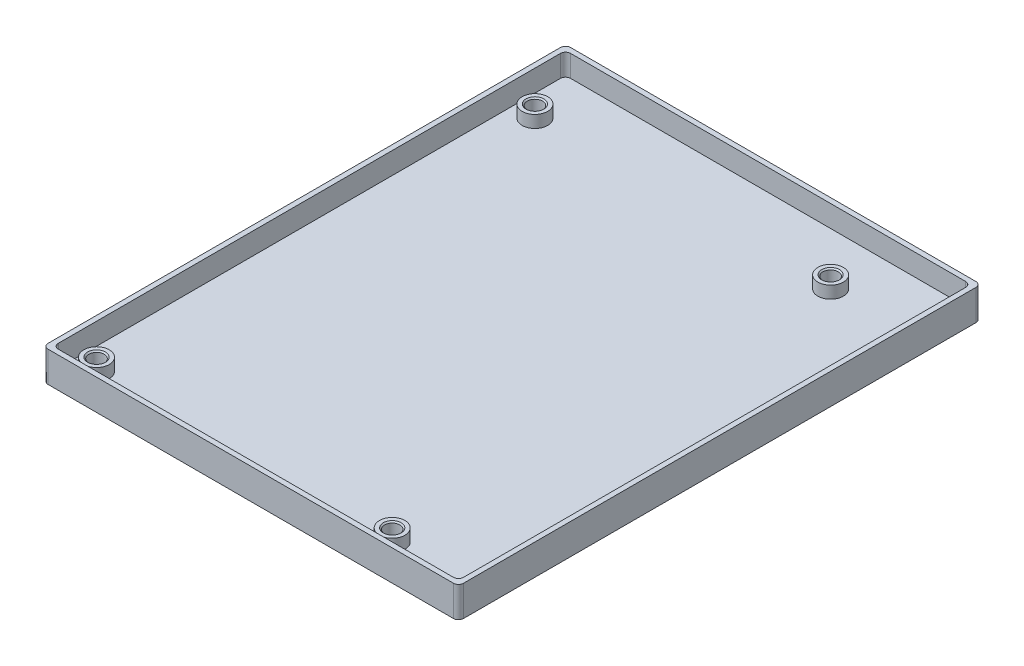
ISO-10303-21;
HEADER;
FILE_DESCRIPTION(('STEP AP214'),'2;1');
FILE_NAME('part.step','',(''),(''),'','','');
FILE_SCHEMA(('AUTOMOTIVE_DESIGN { 1 0 10303 214 1 1 1 1 }'));
ENDSEC;
DATA;
#1=APPLICATION_CONTEXT('core data for automotive mechanical design processes');
#2=APPLICATION_PROTOCOL_DEFINITION('international standard','automotive_design',2000,#1);
#3=PRODUCT_CONTEXT('',#1,'mechanical');
#4=PRODUCT('Part','Part','',(#3));
#5=PRODUCT_RELATED_PRODUCT_CATEGORY('part','',(#4));
#6=PRODUCT_DEFINITION_FORMATION('','',#4);
#7=PRODUCT_DEFINITION_CONTEXT('part definition',#1,'design');
#8=PRODUCT_DEFINITION('design','',#6,#7);
#9=PRODUCT_DEFINITION_SHAPE('','',#8);
#10=(LENGTH_UNIT() NAMED_UNIT(*) SI_UNIT(.MILLI.,.METRE.));
#11=(NAMED_UNIT(*) PLANE_ANGLE_UNIT() SI_UNIT($,.RADIAN.));
#12=(NAMED_UNIT(*) SI_UNIT($,.STERADIAN.) SOLID_ANGLE_UNIT());
#13=UNCERTAINTY_MEASURE_WITH_UNIT(LENGTH_MEASURE(1.E-05),#10,'distance_accuracy_value','');
#14=(GEOMETRIC_REPRESENTATION_CONTEXT(3) GLOBAL_UNCERTAINTY_ASSIGNED_CONTEXT((#13)) GLOBAL_UNIT_ASSIGNED_CONTEXT((#10,
#11,#12)) REPRESENTATION_CONTEXT('',''));
#15=CARTESIAN_POINT('',(0.,0.,0.));
#16=DIRECTION('',(0.,0.,1.));
#17=DIRECTION('',(1.,0.,0.));
#18=AXIS2_PLACEMENT_3D('',#15,#16,#17);
#19=CARTESIAN_POINT('',(0.,4.15,0.));
#20=DIRECTION('',(0.,1.,0.));
#21=DIRECTION('',(0.,0.,1.));
#22=AXIS2_PLACEMENT_3D('',#19,#20,#21);
#23=PLANE('',#22);
#24=CARTESIAN_POINT('',(-35.5,4.15,-40.0000000000002));
#25=DIRECTION('',(0.,1.,0.));
#26=DIRECTION('',(0.,0.,1.));
#27=AXIS2_PLACEMENT_3D('',#24,#25,#26);
#28=CIRCLE('',#27,1.75000000000003);
#29=CARTESIAN_POINT('',(-35.5,4.15,-38.2500000000002));
#30=VERTEX_POINT('',#29);
#31=EDGE_CURVE('E270',#30,#30,#28,.F.);
#32=ORIENTED_EDGE('',*,*,#31,.T.);
#33=EDGE_LOOP('',(#32));
#34=FACE_BOUND('',#33,.T.);
#35=CARTESIAN_POINT('',(-35.5,4.15,-40.0000000000002));
#36=DIRECTION('',(0.,1.,0.));
#37=DIRECTION('',(0.,0.,1.));
#38=AXIS2_PLACEMENT_3D('',#35,#36,#37);
#39=CIRCLE('',#38,2.5);
#40=CARTESIAN_POINT('',(-35.5,4.15,-37.5000000000002));
#41=VERTEX_POINT('',#40);
#42=EDGE_CURVE('E333',#41,#41,#39,.T.);
#43=ORIENTED_EDGE('',*,*,#42,.T.);
#44=EDGE_LOOP('',(#43));
#45=FACE_BOUND('',#44,.T.);
#46=ADVANCED_FACE('F39',(#34,#45),#23,.T.);
#47=CARTESIAN_POINT('',(22.5,4.15,-40.0000000000002));
#48=DIRECTION('',(0.,1.,0.));
#49=DIRECTION('',(0.,0.,1.));
#50=AXIS2_PLACEMENT_3D('',#47,#48,#49);
#51=CIRCLE('',#50,1.75000000000003);
#52=CARTESIAN_POINT('',(22.5,4.15,-38.2500000000002));
#53=VERTEX_POINT('',#52);
#54=EDGE_CURVE('E264',#53,#53,#51,.F.);
#55=ORIENTED_EDGE('',*,*,#54,.T.);
#56=EDGE_LOOP('',(#55));
#57=FACE_BOUND('',#56,.T.);
#58=CARTESIAN_POINT('',(22.5,4.15,-40.0000000000002));
#59=DIRECTION('',(0.,1.,0.));
#60=DIRECTION('',(0.,0.,1.));
#61=AXIS2_PLACEMENT_3D('',#58,#59,#60);
#62=CIRCLE('',#61,2.5);
#63=CARTESIAN_POINT('',(22.5,4.15,-37.5000000000002));
#64=VERTEX_POINT('',#63);
#65=EDGE_CURVE('E327',#64,#64,#62,.T.);
#66=ORIENTED_EDGE('',*,*,#65,.T.);
#67=EDGE_LOOP('',(#66));
#68=FACE_BOUND('',#67,.T.);
#69=ADVANCED_FACE('F291',(#57,#68),#23,.T.);
#70=CARTESIAN_POINT('',(-35.5,4.15,46.0000000000002));
#71=DIRECTION('',(0.,1.,0.));
#72=DIRECTION('',(0.,0.,1.));
#73=AXIS2_PLACEMENT_3D('',#70,#71,#72);
#74=CIRCLE('',#73,1.74999999999999);
#75=CARTESIAN_POINT('',(-35.5,4.15,47.7500000000002));
#76=VERTEX_POINT('',#75);
#77=EDGE_CURVE('E48',#76,#76,#74,.F.);
#78=ORIENTED_EDGE('',*,*,#77,.T.);
#79=EDGE_LOOP('',(#78));
#80=FACE_BOUND('',#79,.T.);
#81=CARTESIAN_POINT('',(-35.5,4.15,46.0000000000002));
#82=DIRECTION('',(0.,1.,0.));
#83=DIRECTION('',(0.,0.,1.));
#84=AXIS2_PLACEMENT_3D('',#81,#82,#83);
#85=CIRCLE('',#84,2.5);
#86=CARTESIAN_POINT('',(-35.5,4.15,48.5000000000002));
#87=VERTEX_POINT('',#86);
#88=EDGE_CURVE('E321',#87,#87,#85,.T.);
#89=ORIENTED_EDGE('',*,*,#88,.T.);
#90=EDGE_LOOP('',(#89));
#91=FACE_BOUND('',#90,.T.);
#92=ADVANCED_FACE('F278',(#80,#91),#23,.T.);
#93=CARTESIAN_POINT('',(22.5,4.15,46.0000000000002));
#94=DIRECTION('',(0.,1.,0.));
#95=DIRECTION('',(0.,0.,1.));
#96=AXIS2_PLACEMENT_3D('',#93,#94,#95);
#97=CIRCLE('',#96,1.74999999999999);
#98=CARTESIAN_POINT('',(22.5,4.15,47.7500000000002));
#99=VERTEX_POINT('',#98);
#100=EDGE_CURVE('E258',#99,#99,#97,.F.);
#101=ORIENTED_EDGE('',*,*,#100,.T.);
#102=EDGE_LOOP('',(#101));
#103=FACE_BOUND('',#102,.T.);
#104=CARTESIAN_POINT('',(22.5,4.15,46.0000000000002));
#105=DIRECTION('',(0.,1.,0.));
#106=DIRECTION('',(0.,0.,1.));
#107=AXIS2_PLACEMENT_3D('',#104,#105,#106);
#108=CIRCLE('',#107,2.5);
#109=CARTESIAN_POINT('',(22.5,4.15,48.5000000000002));
#110=VERTEX_POINT('',#109);
#111=EDGE_CURVE('E316',#110,#110,#108,.T.);
#112=ORIENTED_EDGE('',*,*,#111,.T.);
#113=EDGE_LOOP('',(#112));
#114=FACE_BOUND('',#113,.T.);
#115=ADVANCED_FACE('F294',(#103,#114),#23,.T.);
#116=CARTESIAN_POINT('',(-35.5,0.,46.0000000000002));
#117=DIRECTION('',(0.,1.,0.));
#118=DIRECTION('',(0.,0.,1.));
#119=AXIS2_PLACEMENT_3D('',#116,#117,#118);
#120=CYLINDRICAL_SURFACE('',#119,1.5);
#121=CARTESIAN_POINT('',(-35.5,3.90000000000002,46.0000000000002));
#122=DIRECTION('',(0.,1.,0.));
#123=DIRECTION('',(0.,0.,1.));
#124=AXIS2_PLACEMENT_3D('',#121,#122,#123);
#125=CIRCLE('',#124,1.5);
#126=CARTESIAN_POINT('',(-35.5,3.90000000000002,47.5000000000002));
#127=VERTEX_POINT('',#126);
#128=EDGE_CURVE('E11',#127,#127,#125,.T.);
#129=ORIENTED_EDGE('',*,*,#128,.T.);
#130=EDGE_LOOP('',(#129));
#131=FACE_BOUND('',#130,.T.);
#132=CARTESIAN_POINT('',(-35.5,0.,46.0000000000002));
#133=DIRECTION('',(0.,1.,0.));
#134=DIRECTION('',(0.,0.,1.));
#135=AXIS2_PLACEMENT_3D('',#132,#133,#134);
#136=CIRCLE('',#135,1.5);
#137=CARTESIAN_POINT('',(-35.5,0.,47.5000000000002));
#138=VERTEX_POINT('',#137);
#139=EDGE_CURVE('E182',#138,#138,#136,.T.);
#140=ORIENTED_EDGE('',*,*,#139,.F.);
#141=EDGE_LOOP('',(#140));
#142=FACE_BOUND('',#141,.T.);
#143=ADVANCED_FACE('F303',(#131,#142),#120,.F.);
#144=CARTESIAN_POINT('',(22.5,0.,-40.0000000000002));
#145=DIRECTION('',(0.,1.,0.));
#146=DIRECTION('',(0.,0.,1.));
#147=AXIS2_PLACEMENT_3D('',#144,#145,#146);
#148=CYLINDRICAL_SURFACE('',#147,1.5);
#149=CARTESIAN_POINT('',(22.5,3.89999999999998,-40.0000000000002));
#150=DIRECTION('',(0.,1.,0.));
#151=DIRECTION('',(0.,0.,1.));
#152=AXIS2_PLACEMENT_3D('',#149,#150,#151);
#153=CIRCLE('',#152,1.5);
#154=CARTESIAN_POINT('',(22.5,3.89999999999998,-38.5000000000002));
#155=VERTEX_POINT('',#154);
#156=EDGE_CURVE('E267',#155,#155,#153,.T.);
#157=ORIENTED_EDGE('',*,*,#156,.T.);
#158=EDGE_LOOP('',(#157));
#159=FACE_BOUND('',#158,.T.);
#160=CARTESIAN_POINT('',(22.5,0.,-40.0000000000002));
#161=DIRECTION('',(0.,1.,0.));
#162=DIRECTION('',(0.,0.,1.));
#163=AXIS2_PLACEMENT_3D('',#160,#161,#162);
#164=CIRCLE('',#163,1.5);
#165=CARTESIAN_POINT('',(22.5,0.,-38.5000000000002));
#166=VERTEX_POINT('',#165);
#167=EDGE_CURVE('E362',#166,#166,#164,.T.);
#168=ORIENTED_EDGE('',*,*,#167,.F.);
#169=EDGE_LOOP('',(#168));
#170=FACE_BOUND('',#169,.T.);
#171=ADVANCED_FACE('F309',(#159,#170),#148,.F.);
#172=CARTESIAN_POINT('',(22.5,0.,46.0000000000002));
#173=DIRECTION('',(0.,1.,0.));
#174=DIRECTION('',(0.,0.,1.));
#175=AXIS2_PLACEMENT_3D('',#172,#173,#174);
#176=CYLINDRICAL_SURFACE('',#175,1.5);
#177=CARTESIAN_POINT('',(22.5,3.90000000000002,46.0000000000002));
#178=DIRECTION('',(0.,1.,0.));
#179=DIRECTION('',(0.,0.,1.));
#180=AXIS2_PLACEMENT_3D('',#177,#178,#179);
#181=CIRCLE('',#180,1.5);
#182=CARTESIAN_POINT('',(22.5,3.90000000000002,47.5000000000002));
#183=VERTEX_POINT('',#182);
#184=EDGE_CURVE('E261',#183,#183,#181,.T.);
#185=ORIENTED_EDGE('',*,*,#184,.T.);
#186=EDGE_LOOP('',(#185));
#187=FACE_BOUND('',#186,.T.);
#188=CARTESIAN_POINT('',(22.5,0.,46.0000000000002));
#189=DIRECTION('',(0.,1.,0.));
#190=DIRECTION('',(0.,0.,1.));
#191=AXIS2_PLACEMENT_3D('',#188,#189,#190);
#192=CIRCLE('',#191,1.5);
#193=CARTESIAN_POINT('',(22.5,0.,47.5000000000002));
#194=VERTEX_POINT('',#193);
#195=EDGE_CURVE('E365',#194,#194,#192,.T.);
#196=ORIENTED_EDGE('',*,*,#195,.F.);
#197=EDGE_LOOP('',(#196));
#198=FACE_BOUND('',#197,.T.);
#199=ADVANCED_FACE('F534',(#187,#198),#176,.F.);
#200=CARTESIAN_POINT('',(-35.5,0.,-40.0000000000002));
#201=DIRECTION('',(0.,1.,0.));
#202=DIRECTION('',(0.,0.,1.));
#203=AXIS2_PLACEMENT_3D('',#200,#201,#202);
#204=CYLINDRICAL_SURFACE('',#203,1.5);
#205=CARTESIAN_POINT('',(-35.5,3.89999999999998,-40.0000000000002));
#206=DIRECTION('',(0.,1.,0.));
#207=DIRECTION('',(0.,0.,1.));
#208=AXIS2_PLACEMENT_3D('',#205,#206,#207);
#209=CIRCLE('',#208,1.5);
#210=CARTESIAN_POINT('',(-35.5,3.89999999999998,-38.5000000000002));
#211=VERTEX_POINT('',#210);
#212=EDGE_CURVE('E273',#211,#211,#209,.T.);
#213=ORIENTED_EDGE('',*,*,#212,.T.);
#214=EDGE_LOOP('',(#213));
#215=FACE_BOUND('',#214,.T.);
#216=CARTESIAN_POINT('',(-35.5,0.,-40.0000000000002));
#217=DIRECTION('',(0.,1.,0.));
#218=DIRECTION('',(0.,0.,1.));
#219=AXIS2_PLACEMENT_3D('',#216,#217,#218);
#220=CIRCLE('',#219,1.5);
#221=CARTESIAN_POINT('',(-35.5,0.,-38.5000000000002));
#222=VERTEX_POINT('',#221);
#223=EDGE_CURVE('E188',#222,#222,#220,.T.);
#224=ORIENTED_EDGE('',*,*,#223,.F.);
#225=EDGE_LOOP('',(#224));
#226=FACE_BOUND('',#225,.T.);
#227=ADVANCED_FACE('F422',(#215,#226),#204,.F.);
#228=CARTESIAN_POINT('',(-40.75,6.,51.25));
#229=DIRECTION('',(0.,0.,-1.));
#230=DIRECTION('',(-1.,0.,0.));
#231=AXIS2_PLACEMENT_3D('',#228,#229,#230);
#232=PLANE('',#231);
#233=DIRECTION('',(1.,0.,0.));
#234=VECTOR('',#233,1.);
#235=CARTESIAN_POINT('',(-40.75,6.,51.25));
#236=LINE('',#235,#234);
#237=CARTESIAN_POINT('',(-39.75,6.,51.25));
#238=VERTEX_POINT('',#237);
#239=CARTESIAN_POINT('',(39.75,6.,51.25));
#240=VERTEX_POINT('',#239);
#241=EDGE_CURVE('E175',#238,#240,#236,.T.);
#242=ORIENTED_EDGE('',*,*,#241,.F.);
#243=DIRECTION('',(0.,-1.,0.));
#244=VECTOR('',#243,1.);
#245=CARTESIAN_POINT('',(-39.75,0.,51.25));
#246=LINE('',#245,#244);
#247=CARTESIAN_POINT('',(-39.75,0.,51.25));
#248=VERTEX_POINT('',#247);
#249=EDGE_CURVE('E159',#238,#248,#246,.T.);
#250=ORIENTED_EDGE('',*,*,#249,.T.);
#251=DIRECTION('',(1.,0.,0.));
#252=VECTOR('',#251,1.);
#253=CARTESIAN_POINT('',(-40.75,0.,51.25));
#254=LINE('',#253,#252);
#255=CARTESIAN_POINT('',(39.75,0.,51.25));
#256=VERTEX_POINT('',#255);
#257=EDGE_CURVE('E172',#248,#256,#254,.T.);
#258=ORIENTED_EDGE('',*,*,#257,.T.);
#259=DIRECTION('',(0.,-1.,0.));
#260=VECTOR('',#259,1.);
#261=CARTESIAN_POINT('',(39.75,6.,51.25));
#262=LINE('',#261,#260);
#263=EDGE_CURVE('E177',#256,#240,#262,.F.);
#264=ORIENTED_EDGE('',*,*,#263,.T.);
#265=EDGE_LOOP('',(#242,#250,#258,#264));
#266=FACE_BOUND('',#265,.T.);
#267=ADVANCED_FACE('F171',(#266),#232,.F.);
#268=CARTESIAN_POINT('',(40.75,6.,51.25));
#269=DIRECTION('',(-1.,0.,0.));
#270=DIRECTION('',(0.,0.,1.));
#271=AXIS2_PLACEMENT_3D('',#268,#269,#270);
#272=PLANE('',#271);
#273=DIRECTION('',(0.,0.,-1.));
#274=VECTOR('',#273,1.);
#275=CARTESIAN_POINT('',(40.75,6.,51.25));
#276=LINE('',#275,#274);
#277=CARTESIAN_POINT('',(40.75,6.,50.25));
#278=VERTEX_POINT('',#277);
#279=CARTESIAN_POINT('',(40.75,6.,-50.25));
#280=VERTEX_POINT('',#279);
#281=EDGE_CURVE('E371',#278,#280,#276,.T.);
#282=ORIENTED_EDGE('',*,*,#281,.F.);
#283=DIRECTION('',(0.,-1.,0.));
#284=VECTOR('',#283,1.);
#285=CARTESIAN_POINT('',(40.75,6.,50.25));
#286=LINE('',#285,#284);
#287=CARTESIAN_POINT('',(40.75,0.,50.25));
#288=VERTEX_POINT('',#287);
#289=EDGE_CURVE('E216',#278,#288,#286,.T.);
#290=ORIENTED_EDGE('',*,*,#289,.T.);
#291=DIRECTION('',(0.,0.,-1.));
#292=VECTOR('',#291,1.);
#293=CARTESIAN_POINT('',(40.75,0.,51.25));
#294=LINE('',#293,#292);
#295=CARTESIAN_POINT('',(40.75,0.,-50.25));
#296=VERTEX_POINT('',#295);
#297=EDGE_CURVE('E181',#288,#296,#294,.T.);
#298=ORIENTED_EDGE('',*,*,#297,.T.);
#299=DIRECTION('',(0.,-1.,0.));
#300=VECTOR('',#299,1.);
#301=CARTESIAN_POINT('',(40.75,6.,-50.25));
#302=LINE('',#301,#300);
#303=EDGE_CURVE('E214',#296,#280,#302,.F.);
#304=ORIENTED_EDGE('',*,*,#303,.T.);
#305=EDGE_LOOP('',(#282,#290,#298,#304));
#306=FACE_BOUND('',#305,.T.);
#307=ADVANCED_FACE('F396',(#306),#272,.F.);
#308=CARTESIAN_POINT('',(-40.75,6.,-51.25));
#309=DIRECTION('',(0.,0.,-1.));
#310=DIRECTION('',(-1.,0.,0.));
#311=AXIS2_PLACEMENT_3D('',#308,#309,#310);
#312=PLANE('',#311);
#313=DIRECTION('',(1.,0.,0.));
#314=VECTOR('',#313,1.);
#315=CARTESIAN_POINT('',(-40.75,6.,-51.25));
#316=LINE('',#315,#314);
#317=CARTESIAN_POINT('',(-39.75,6.,-51.25));
#318=VERTEX_POINT('',#317);
#319=CARTESIAN_POINT('',(39.75,6.,-51.25));
#320=VERTEX_POINT('',#319);
#321=EDGE_CURVE('E373',#318,#320,#316,.T.);
#322=ORIENTED_EDGE('',*,*,#321,.T.);
#323=DIRECTION('',(0.,-1.,0.));
#324=VECTOR('',#323,1.);
#325=CARTESIAN_POINT('',(39.75,0.,-51.25));
#326=LINE('',#325,#324);
#327=CARTESIAN_POINT('',(39.75,0.,-51.25));
#328=VERTEX_POINT('',#327);
#329=EDGE_CURVE('E221',#320,#328,#326,.T.);
#330=ORIENTED_EDGE('',*,*,#329,.T.);
#331=DIRECTION('',(1.,0.,0.));
#332=VECTOR('',#331,1.);
#333=CARTESIAN_POINT('',(-40.75,0.,-51.25));
#334=LINE('',#333,#332);
#335=CARTESIAN_POINT('',(-39.75,0.,-51.25));
#336=VERTEX_POINT('',#335);
#337=EDGE_CURVE('E185',#336,#328,#334,.T.);
#338=ORIENTED_EDGE('',*,*,#337,.F.);
#339=DIRECTION('',(0.,-1.,0.));
#340=VECTOR('',#339,1.);
#341=CARTESIAN_POINT('',(-39.75,6.,-51.25));
#342=LINE('',#341,#340);
#343=EDGE_CURVE('E219',#336,#318,#342,.F.);
#344=ORIENTED_EDGE('',*,*,#343,.T.);
#345=EDGE_LOOP('',(#322,#330,#338,#344));
#346=FACE_BOUND('',#345,.T.);
#347=ADVANCED_FACE('F389',(#346),#312,.T.);
#348=CARTESIAN_POINT('',(-40.75,6.,51.25));
#349=DIRECTION('',(-1.,0.,0.));
#350=DIRECTION('',(0.,0.,1.));
#351=AXIS2_PLACEMENT_3D('',#348,#349,#350);
#352=PLANE('',#351);
#353=DIRECTION('',(0.,0.,-1.));
#354=VECTOR('',#353,1.);
#355=CARTESIAN_POINT('',(-40.75,0.,51.25));
#356=LINE('',#355,#354);
#357=CARTESIAN_POINT('',(-40.75,0.,50.25));
#358=VERTEX_POINT('',#357);
#359=CARTESIAN_POINT('',(-40.75,0.,-50.25));
#360=VERTEX_POINT('',#359);
#361=EDGE_CURVE('E196',#358,#360,#356,.T.);
#362=ORIENTED_EDGE('',*,*,#361,.F.);
#363=DIRECTION('',(0.,-1.,0.));
#364=VECTOR('',#363,1.);
#365=CARTESIAN_POINT('',(-40.75,6.,50.25));
#366=LINE('',#365,#364);
#367=CARTESIAN_POINT('',(-40.75,6.,50.25));
#368=VERTEX_POINT('',#367);
#369=EDGE_CURVE('E160',#358,#368,#366,.F.);
#370=ORIENTED_EDGE('',*,*,#369,.T.);
#371=DIRECTION('',(0.,0.,-1.));
#372=VECTOR('',#371,1.);
#373=CARTESIAN_POINT('',(-40.75,6.,51.25));
#374=LINE('',#373,#372);
#375=CARTESIAN_POINT('',(-40.75,6.,-50.25));
#376=VERTEX_POINT('',#375);
#377=EDGE_CURVE('E191',#368,#376,#374,.T.);
#378=ORIENTED_EDGE('',*,*,#377,.T.);
#379=DIRECTION('',(0.,-1.,0.));
#380=VECTOR('',#379,1.);
#381=CARTESIAN_POINT('',(-40.75,6.,-50.25));
#382=LINE('',#381,#380);
#383=EDGE_CURVE('E165',#376,#360,#382,.T.);
#384=ORIENTED_EDGE('',*,*,#383,.T.);
#385=EDGE_LOOP('',(#362,#370,#378,#384));
#386=FACE_BOUND('',#385,.T.);
#387=ADVANCED_FACE('F382',(#386),#352,.T.);
#388=CARTESIAN_POINT('',(0.,6.,0.));
#389=DIRECTION('',(0.,1.,0.));
#390=DIRECTION('',(0.,0.,1.));
#391=AXIS2_PLACEMENT_3D('',#388,#389,#390);
#392=PLANE('',#391);
#393=DIRECTION('',(0.,0.,1.));
#394=VECTOR('',#393,1.);
#395=CARTESIAN_POINT('',(-39.75,6.,50.25));
#396=LINE('',#395,#394);
#397=CARTESIAN_POINT('',(-39.75,6.,-49.25));
#398=VERTEX_POINT('',#397);
#399=CARTESIAN_POINT('',(-39.75,6.,49.25));
#400=VERTEX_POINT('',#399);
#401=EDGE_CURVE('E351',#398,#400,#396,.T.);
#402=ORIENTED_EDGE('',*,*,#401,.F.);
#403=CARTESIAN_POINT('',(-38.75,6.,-49.25));
#404=DIRECTION('',(0.,1.,0.));
#405=DIRECTION('',(0.,0.,1.));
#406=AXIS2_PLACEMENT_3D('',#403,#404,#405);
#407=CIRCLE('',#406,1.);
#408=CARTESIAN_POINT('',(-38.75,6.,-50.25));
#409=VERTEX_POINT('',#408);
#410=EDGE_CURVE('E256',#398,#409,#407,.F.);
#411=ORIENTED_EDGE('',*,*,#410,.T.);
#412=DIRECTION('',(-1.,0.,0.));
#413=VECTOR('',#412,1.);
#414=CARTESIAN_POINT('',(39.75,6.,-50.25));
#415=LINE('',#414,#413);
#416=CARTESIAN_POINT('',(38.75,6.,-50.25));
#417=VERTEX_POINT('',#416);
#418=EDGE_CURVE('E359',#417,#409,#415,.T.);
#419=ORIENTED_EDGE('',*,*,#418,.F.);
#420=CARTESIAN_POINT('',(38.75,6.,-49.25));
#421=DIRECTION('',(0.,1.,0.));
#422=DIRECTION('',(0.,0.,1.));
#423=AXIS2_PLACEMENT_3D('',#420,#421,#422);
#424=CIRCLE('',#423,1.);
#425=CARTESIAN_POINT('',(39.75,6.,-49.25));
#426=VERTEX_POINT('',#425);
#427=EDGE_CURVE('E250',#417,#426,#424,.F.);
#428=ORIENTED_EDGE('',*,*,#427,.T.);
#429=DIRECTION('',(0.,0.,-1.));
#430=VECTOR('',#429,1.);
#431=CARTESIAN_POINT('',(39.75,6.,50.25));
#432=LINE('',#431,#430);
#433=CARTESIAN_POINT('',(39.75,6.,49.25));
#434=VERTEX_POINT('',#433);
#435=EDGE_CURVE('E356',#434,#426,#432,.T.);
#436=ORIENTED_EDGE('',*,*,#435,.F.);
#437=CARTESIAN_POINT('',(38.75,6.,49.25));
#438=DIRECTION('',(0.,1.,0.));
#439=DIRECTION('',(0.,0.,1.));
#440=AXIS2_PLACEMENT_3D('',#437,#438,#439);
#441=CIRCLE('',#440,1.);
#442=CARTESIAN_POINT('',(38.75,6.,50.25));
#443=VERTEX_POINT('',#442);
#444=EDGE_CURVE('E252',#434,#443,#441,.F.);
#445=ORIENTED_EDGE('',*,*,#444,.T.);
#446=DIRECTION('',(1.,0.,0.));
#447=VECTOR('',#446,1.);
#448=CARTESIAN_POINT('',(39.75,6.,50.25));
#449=LINE('',#448,#447);
#450=CARTESIAN_POINT('',(-38.75,6.,50.25));
#451=VERTEX_POINT('',#450);
#452=EDGE_CURVE('E354',#451,#443,#449,.T.);
#453=ORIENTED_EDGE('',*,*,#452,.F.);
#454=CARTESIAN_POINT('',(-38.75,6.,49.25));
#455=DIRECTION('',(0.,1.,0.));
#456=DIRECTION('',(0.,0.,1.));
#457=AXIS2_PLACEMENT_3D('',#454,#455,#456);
#458=CIRCLE('',#457,1.);
#459=EDGE_CURVE('E254',#451,#400,#458,.F.);
#460=ORIENTED_EDGE('',*,*,#459,.T.);
#461=EDGE_LOOP('',(#402,#411,#419,#428,#436,#445,#453,#460));
#462=FACE_BOUND('',#461,.T.);
#463=ORIENTED_EDGE('',*,*,#377,.F.);
#464=CARTESIAN_POINT('',(-39.75,6.,50.25));
#465=DIRECTION('',(0.,1.,0.));
#466=DIRECTION('',(0.,0.,1.));
#467=AXIS2_PLACEMENT_3D('',#464,#465,#466);
#468=CIRCLE('',#467,1.);
#469=EDGE_CURVE('E212',#368,#238,#468,.T.);
#470=ORIENTED_EDGE('',*,*,#469,.T.);
#471=ORIENTED_EDGE('',*,*,#241,.T.);
#472=CARTESIAN_POINT('',(39.75,6.,50.25));
#473=DIRECTION('',(0.,1.,0.));
#474=DIRECTION('',(0.,0.,1.));
#475=AXIS2_PLACEMENT_3D('',#472,#473,#474);
#476=CIRCLE('',#475,1.);
#477=EDGE_CURVE('E210',#240,#278,#476,.T.);
#478=ORIENTED_EDGE('',*,*,#477,.T.);
#479=ORIENTED_EDGE('',*,*,#281,.T.);
#480=CARTESIAN_POINT('',(39.75,6.,-50.25));
#481=DIRECTION('',(0.,1.,0.));
#482=DIRECTION('',(0.,0.,1.));
#483=AXIS2_PLACEMENT_3D('',#480,#481,#482);
#484=CIRCLE('',#483,1.);
#485=EDGE_CURVE('E208',#280,#320,#484,.T.);
#486=ORIENTED_EDGE('',*,*,#485,.T.);
#487=ORIENTED_EDGE('',*,*,#321,.F.);
#488=CARTESIAN_POINT('',(-39.75,6.,-50.25));
#489=DIRECTION('',(0.,1.,0.));
#490=DIRECTION('',(0.,0.,1.));
#491=AXIS2_PLACEMENT_3D('',#488,#489,#490);
#492=CIRCLE('',#491,1.);
#493=EDGE_CURVE('E206',#318,#376,#492,.T.);
#494=ORIENTED_EDGE('',*,*,#493,.T.);
#495=EDGE_LOOP('',(#463,#470,#471,#478,#479,#486,#487,#494));
#496=FACE_BOUND('',#495,.T.);
#497=ADVANCED_FACE('F401',(#462,#496),#392,.T.);
#498=CARTESIAN_POINT('',(0.,0.,0.));
#499=DIRECTION('',(0.,1.,0.));
#500=DIRECTION('',(0.,0.,1.));
#501=AXIS2_PLACEMENT_3D('',#498,#499,#500);
#502=PLANE('',#501);
#503=ORIENTED_EDGE('',*,*,#223,.T.);
#504=EDGE_LOOP('',(#503));
#505=FACE_BOUND('',#504,.T.);
#506=ORIENTED_EDGE('',*,*,#195,.T.);
#507=EDGE_LOOP('',(#506));
#508=FACE_BOUND('',#507,.T.);
#509=ORIENTED_EDGE('',*,*,#167,.T.);
#510=EDGE_LOOP('',(#509));
#511=FACE_BOUND('',#510,.T.);
#512=ORIENTED_EDGE('',*,*,#139,.T.);
#513=EDGE_LOOP('',(#512));
#514=FACE_BOUND('',#513,.T.);
#515=ORIENTED_EDGE('',*,*,#257,.F.);
#516=CARTESIAN_POINT('',(-39.75,0.,50.25));
#517=DIRECTION('',(0.,1.,0.));
#518=DIRECTION('',(0.,0.,1.));
#519=AXIS2_PLACEMENT_3D('',#516,#517,#518);
#520=CIRCLE('',#519,1.);
#521=EDGE_CURVE('E155',#248,#358,#520,.F.);
#522=ORIENTED_EDGE('',*,*,#521,.T.);
#523=ORIENTED_EDGE('',*,*,#361,.T.);
#524=CARTESIAN_POINT('',(-39.75,0.,-50.25));
#525=DIRECTION('',(0.,1.,0.));
#526=DIRECTION('',(0.,0.,1.));
#527=AXIS2_PLACEMENT_3D('',#524,#525,#526);
#528=CIRCLE('',#527,1.);
#529=EDGE_CURVE('E176',#360,#336,#528,.F.);
#530=ORIENTED_EDGE('',*,*,#529,.T.);
#531=ORIENTED_EDGE('',*,*,#337,.T.);
#532=CARTESIAN_POINT('',(39.75,0.,-50.25));
#533=DIRECTION('',(0.,1.,0.));
#534=DIRECTION('',(0.,0.,1.));
#535=AXIS2_PLACEMENT_3D('',#532,#533,#534);
#536=CIRCLE('',#535,1.);
#537=EDGE_CURVE('E200',#328,#296,#536,.F.);
#538=ORIENTED_EDGE('',*,*,#537,.T.);
#539=ORIENTED_EDGE('',*,*,#297,.F.);
#540=CARTESIAN_POINT('',(39.75,0.,50.25));
#541=DIRECTION('',(0.,1.,0.));
#542=DIRECTION('',(0.,0.,1.));
#543=AXIS2_PLACEMENT_3D('',#540,#541,#542);
#544=CIRCLE('',#543,1.);
#545=EDGE_CURVE('E166',#288,#256,#544,.F.);
#546=ORIENTED_EDGE('',*,*,#545,.T.);
#547=EDGE_LOOP('',(#515,#522,#523,#530,#531,#538,#539,#546));
#548=FACE_BOUND('',#547,.T.);
#549=ADVANCED_FACE('F179',(#505,#508,#511,#514,#548),#502,.F.);
#550=CARTESIAN_POINT('',(-39.75,4.15,50.25));
#551=DIRECTION('',(-1.,0.,0.));
#552=DIRECTION('',(0.,0.,1.));
#553=AXIS2_PLACEMENT_3D('',#550,#551,#552);
#554=PLANE('',#553);
#555=ORIENTED_EDGE('',*,*,#401,.T.);
#556=DIRECTION('',(0.,1.,0.));
#557=VECTOR('',#556,1.);
#558=CARTESIAN_POINT('',(-39.75,1.75,49.25));
#559=LINE('',#558,#557);
#560=CARTESIAN_POINT('',(-39.75,1.75,49.25));
#561=VERTEX_POINT('',#560);
#562=EDGE_CURVE('E248',#400,#561,#559,.F.);
#563=ORIENTED_EDGE('',*,*,#562,.T.);
#564=DIRECTION('',(0.,0.,1.));
#565=VECTOR('',#564,1.);
#566=CARTESIAN_POINT('',(-39.75,1.75,-50.25));
#567=LINE('',#566,#565);
#568=CARTESIAN_POINT('',(-39.75,1.75,-49.25));
#569=VERTEX_POINT('',#568);
#570=EDGE_CURVE('E339',#569,#561,#567,.T.);
#571=ORIENTED_EDGE('',*,*,#570,.F.);
#572=DIRECTION('',(0.,1.,0.));
#573=VECTOR('',#572,1.);
#574=CARTESIAN_POINT('',(-39.75,6.,-49.25));
#575=LINE('',#574,#573);
#576=EDGE_CURVE('E245',#569,#398,#575,.T.);
#577=ORIENTED_EDGE('',*,*,#576,.T.);
#578=EDGE_LOOP('',(#555,#563,#571,#577));
#579=FACE_BOUND('',#578,.T.);
#580=ADVANCED_FACE('F409',(#579),#554,.F.);
#581=CARTESIAN_POINT('',(39.75,4.15,-50.25));
#582=DIRECTION('',(0.,0.,-1.));
#583=DIRECTION('',(-1.,0.,0.));
#584=AXIS2_PLACEMENT_3D('',#581,#582,#583);
#585=PLANE('',#584);
#586=DIRECTION('',(-1.,0.,0.));
#587=VECTOR('',#586,1.);
#588=CARTESIAN_POINT('',(-39.75,1.75,-50.25));
#589=LINE('',#588,#587);
#590=CARTESIAN_POINT('',(38.75,1.75,-50.25));
#591=VERTEX_POINT('',#590);
#592=CARTESIAN_POINT('',(-38.75,1.75,-50.25));
#593=VERTEX_POINT('',#592);
#594=EDGE_CURVE('E348',#591,#593,#589,.T.);
#595=ORIENTED_EDGE('',*,*,#594,.F.);
#596=DIRECTION('',(0.,1.,0.));
#597=VECTOR('',#596,1.);
#598=CARTESIAN_POINT('',(38.75,6.,-50.25));
#599=LINE('',#598,#597);
#600=EDGE_CURVE('E226',#591,#417,#599,.T.);
#601=ORIENTED_EDGE('',*,*,#600,.T.);
#602=ORIENTED_EDGE('',*,*,#418,.T.);
#603=DIRECTION('',(0.,1.,0.));
#604=VECTOR('',#603,1.);
#605=CARTESIAN_POINT('',(-38.75,1.75,-50.25));
#606=LINE('',#605,#604);
#607=EDGE_CURVE('E224',#409,#593,#606,.F.);
#608=ORIENTED_EDGE('',*,*,#607,.T.);
#609=EDGE_LOOP('',(#595,#601,#602,#608));
#610=FACE_BOUND('',#609,.T.);
#611=ADVANCED_FACE('F514',(#610),#585,.F.);
#612=CARTESIAN_POINT('',(39.75,4.15,50.25));
#613=DIRECTION('',(1.,0.,0.));
#614=DIRECTION('',(0.,0.,-1.));
#615=AXIS2_PLACEMENT_3D('',#612,#613,#614);
#616=PLANE('',#615);
#617=ORIENTED_EDGE('',*,*,#435,.T.);
#618=DIRECTION('',(0.,1.,0.));
#619=VECTOR('',#618,1.);
#620=CARTESIAN_POINT('',(39.75,1.75,-49.25));
#621=LINE('',#620,#619);
#622=CARTESIAN_POINT('',(39.75,1.75,-49.25));
#623=VERTEX_POINT('',#622);
#624=EDGE_CURVE('E232',#426,#623,#621,.F.);
#625=ORIENTED_EDGE('',*,*,#624,.T.);
#626=DIRECTION('',(0.,0.,-1.));
#627=VECTOR('',#626,1.);
#628=CARTESIAN_POINT('',(39.75,1.75,-50.25));
#629=LINE('',#628,#627);
#630=CARTESIAN_POINT('',(39.75,1.75,49.25));
#631=VERTEX_POINT('',#630);
#632=EDGE_CURVE('E345',#631,#623,#629,.T.);
#633=ORIENTED_EDGE('',*,*,#632,.F.);
#634=DIRECTION('',(0.,1.,0.));
#635=VECTOR('',#634,1.);
#636=CARTESIAN_POINT('',(39.75,6.,49.25));
#637=LINE('',#636,#635);
#638=EDGE_CURVE('E229',#631,#434,#637,.T.);
#639=ORIENTED_EDGE('',*,*,#638,.T.);
#640=EDGE_LOOP('',(#617,#625,#633,#639));
#641=FACE_BOUND('',#640,.T.);
#642=ADVANCED_FACE('F495',(#641),#616,.F.);
#643=CARTESIAN_POINT('',(39.75,4.15,50.25));
#644=DIRECTION('',(0.,0.,1.));
#645=DIRECTION('',(1.,0.,0.));
#646=AXIS2_PLACEMENT_3D('',#643,#644,#645);
#647=PLANE('',#646);
#648=ORIENTED_EDGE('',*,*,#452,.T.);
#649=DIRECTION('',(0.,1.,0.));
#650=VECTOR('',#649,1.);
#651=CARTESIAN_POINT('',(38.75,1.75,50.25));
#652=LINE('',#651,#650);
#653=CARTESIAN_POINT('',(38.75,1.75,50.25));
#654=VERTEX_POINT('',#653);
#655=EDGE_CURVE('E55',#443,#654,#652,.F.);
#656=ORIENTED_EDGE('',*,*,#655,.T.);
#657=DIRECTION('',(1.,0.,0.));
#658=VECTOR('',#657,1.);
#659=CARTESIAN_POINT('',(-39.75,1.75,50.25));
#660=LINE('',#659,#658);
#661=CARTESIAN_POINT('',(-38.75,1.75,50.25));
#662=VERTEX_POINT('',#661);
#663=EDGE_CURVE('E343',#662,#654,#660,.T.);
#664=ORIENTED_EDGE('',*,*,#663,.F.);
#665=DIRECTION('',(0.,1.,0.));
#666=VECTOR('',#665,1.);
#667=CARTESIAN_POINT('',(-38.75,6.,50.25));
#668=LINE('',#667,#666);
#669=EDGE_CURVE('E241',#662,#451,#668,.T.);
#670=ORIENTED_EDGE('',*,*,#669,.T.);
#671=EDGE_LOOP('',(#648,#656,#664,#670));
#672=FACE_BOUND('',#671,.T.);
#673=ADVANCED_FACE('F490',(#672),#647,.F.);
#674=CARTESIAN_POINT('',(0.,1.75,0.));
#675=DIRECTION('',(0.,1.,0.));
#676=DIRECTION('',(0.,0.,1.));
#677=AXIS2_PLACEMENT_3D('',#674,#675,#676);
#678=PLANE('',#677);
#679=CARTESIAN_POINT('',(22.5,1.75,46.0000000000002));
#680=DIRECTION('',(0.,1.,0.));
#681=DIRECTION('',(0.,0.,1.));
#682=AXIS2_PLACEMENT_3D('',#679,#680,#681);
#683=CIRCLE('',#682,2.5);
#684=CARTESIAN_POINT('',(22.5,1.75,48.5000000000002));
#685=VERTEX_POINT('',#684);
#686=EDGE_CURVE('E318',#685,#685,#683,.T.);
#687=ORIENTED_EDGE('',*,*,#686,.F.);
#688=EDGE_LOOP('',(#687));
#689=FACE_BOUND('',#688,.T.);
#690=CARTESIAN_POINT('',(-35.5,1.75,46.0000000000002));
#691=DIRECTION('',(0.,1.,0.));
#692=DIRECTION('',(0.,0.,1.));
#693=AXIS2_PLACEMENT_3D('',#690,#691,#692);
#694=CIRCLE('',#693,2.5);
#695=CARTESIAN_POINT('',(-35.5,1.75,48.5000000000002));
#696=VERTEX_POINT('',#695);
#697=EDGE_CURVE('E324',#696,#696,#694,.T.);
#698=ORIENTED_EDGE('',*,*,#697,.F.);
#699=EDGE_LOOP('',(#698));
#700=FACE_BOUND('',#699,.T.);
#701=CARTESIAN_POINT('',(22.5,1.75,-40.0000000000002));
#702=DIRECTION('',(0.,1.,0.));
#703=DIRECTION('',(0.,0.,1.));
#704=AXIS2_PLACEMENT_3D('',#701,#702,#703);
#705=CIRCLE('',#704,2.5);
#706=CARTESIAN_POINT('',(22.5,1.75,-37.5000000000002));
#707=VERTEX_POINT('',#706);
#708=EDGE_CURVE('E330',#707,#707,#705,.T.);
#709=ORIENTED_EDGE('',*,*,#708,.F.);
#710=EDGE_LOOP('',(#709));
#711=FACE_BOUND('',#710,.T.);
#712=CARTESIAN_POINT('',(-35.5,1.75,-40.0000000000002));
#713=DIRECTION('',(0.,1.,0.));
#714=DIRECTION('',(0.,0.,1.));
#715=AXIS2_PLACEMENT_3D('',#712,#713,#714);
#716=CIRCLE('',#715,2.5);
#717=CARTESIAN_POINT('',(-35.5,1.75,-37.5000000000002));
#718=VERTEX_POINT('',#717);
#719=EDGE_CURVE('E336',#718,#718,#716,.T.);
#720=ORIENTED_EDGE('',*,*,#719,.F.);
#721=EDGE_LOOP('',(#720));
#722=FACE_BOUND('',#721,.T.);
#723=ORIENTED_EDGE('',*,*,#632,.T.);
#724=CARTESIAN_POINT('',(38.75,1.75,-49.25));
#725=DIRECTION('',(0.,1.,0.));
#726=DIRECTION('',(0.,0.,1.));
#727=AXIS2_PLACEMENT_3D('',#724,#725,#726);
#728=CIRCLE('',#727,1.);
#729=EDGE_CURVE('E239',#623,#591,#728,.T.);
#730=ORIENTED_EDGE('',*,*,#729,.T.);
#731=ORIENTED_EDGE('',*,*,#594,.T.);
#732=CARTESIAN_POINT('',(-38.75,1.75,-49.25));
#733=DIRECTION('',(0.,1.,0.));
#734=DIRECTION('',(0.,0.,1.));
#735=AXIS2_PLACEMENT_3D('',#732,#733,#734);
#736=CIRCLE('',#735,1.);
#737=EDGE_CURVE('E234',#593,#569,#736,.T.);
#738=ORIENTED_EDGE('',*,*,#737,.T.);
#739=ORIENTED_EDGE('',*,*,#570,.T.);
#740=CARTESIAN_POINT('',(-38.75,1.75,49.25));
#741=DIRECTION('',(0.,1.,0.));
#742=DIRECTION('',(0.,0.,1.));
#743=AXIS2_PLACEMENT_3D('',#740,#741,#742);
#744=CIRCLE('',#743,1.);
#745=EDGE_CURVE('E62',#561,#662,#744,.T.);
#746=ORIENTED_EDGE('',*,*,#745,.T.);
#747=ORIENTED_EDGE('',*,*,#663,.T.);
#748=CARTESIAN_POINT('',(38.75,1.75,49.25));
#749=DIRECTION('',(0.,1.,0.));
#750=DIRECTION('',(0.,0.,1.));
#751=AXIS2_PLACEMENT_3D('',#748,#749,#750);
#752=CIRCLE('',#751,1.);
#753=EDGE_CURVE('E237',#654,#631,#752,.T.);
#754=ORIENTED_EDGE('',*,*,#753,.T.);
#755=EDGE_LOOP('',(#723,#730,#731,#738,#739,#746,#747,#754));
#756=FACE_BOUND('',#755,.T.);
#757=ADVANCED_FACE('F485',(#689,#700,#711,#722,#756),#678,.T.);
#758=CARTESIAN_POINT('',(-35.5,1.75,-40.0000000000002));
#759=DIRECTION('',(0.,1.,0.));
#760=DIRECTION('',(0.,0.,1.));
#761=AXIS2_PLACEMENT_3D('',#758,#759,#760);
#762=CYLINDRICAL_SURFACE('',#761,2.5);
#763=ORIENTED_EDGE('',*,*,#719,.T.);
#764=EDGE_LOOP('',(#763));
#765=FACE_BOUND('',#764,.T.);
#766=ORIENTED_EDGE('',*,*,#42,.F.);
#767=EDGE_LOOP('',(#766));
#768=FACE_BOUND('',#767,.T.);
#769=ADVANCED_FACE('F476',(#765,#768),#762,.T.);
#770=CARTESIAN_POINT('',(22.5,1.75,-40.0000000000002));
#771=DIRECTION('',(0.,1.,0.));
#772=DIRECTION('',(0.,0.,1.));
#773=AXIS2_PLACEMENT_3D('',#770,#771,#772);
#774=CYLINDRICAL_SURFACE('',#773,2.5);
#775=ORIENTED_EDGE('',*,*,#708,.T.);
#776=EDGE_LOOP('',(#775));
#777=FACE_BOUND('',#776,.T.);
#778=ORIENTED_EDGE('',*,*,#65,.F.);
#779=EDGE_LOOP('',(#778));
#780=FACE_BOUND('',#779,.T.);
#781=ADVANCED_FACE('F473',(#777,#780),#774,.T.);
#782=CARTESIAN_POINT('',(-35.5,1.75,46.0000000000002));
#783=DIRECTION('',(0.,1.,0.));
#784=DIRECTION('',(0.,0.,1.));
#785=AXIS2_PLACEMENT_3D('',#782,#783,#784);
#786=CYLINDRICAL_SURFACE('',#785,2.5);
#787=ORIENTED_EDGE('',*,*,#697,.T.);
#788=EDGE_LOOP('',(#787));
#789=FACE_BOUND('',#788,.T.);
#790=ORIENTED_EDGE('',*,*,#88,.F.);
#791=EDGE_LOOP('',(#790));
#792=FACE_BOUND('',#791,.T.);
#793=ADVANCED_FACE('F475',(#789,#792),#786,.T.);
#794=CARTESIAN_POINT('',(22.5,1.75,46.0000000000002));
#795=DIRECTION('',(0.,1.,0.));
#796=DIRECTION('',(0.,0.,1.));
#797=AXIS2_PLACEMENT_3D('',#794,#795,#796);
#798=CYLINDRICAL_SURFACE('',#797,2.5);
#799=ORIENTED_EDGE('',*,*,#686,.T.);
#800=EDGE_LOOP('',(#799));
#801=FACE_BOUND('',#800,.T.);
#802=ORIENTED_EDGE('',*,*,#111,.F.);
#803=EDGE_LOOP('',(#802));
#804=FACE_BOUND('',#803,.T.);
#805=ADVANCED_FACE('F425',(#801,#804),#798,.T.);
#806=CARTESIAN_POINT('',(-39.75,6.,50.25));
#807=DIRECTION('',(0.,1.,0.));
#808=DIRECTION('',(0.,0.,1.));
#809=AXIS2_PLACEMENT_3D('',#806,#807,#808);
#810=CYLINDRICAL_SURFACE('',#809,1.);
#811=ORIENTED_EDGE('',*,*,#469,.F.);
#812=ORIENTED_EDGE('',*,*,#369,.F.);
#813=ORIENTED_EDGE('',*,*,#521,.F.);
#814=ORIENTED_EDGE('',*,*,#249,.F.);
#815=EDGE_LOOP('',(#811,#812,#813,#814));
#816=FACE_BOUND('',#815,.T.);
#817=ADVANCED_FACE('F158',(#816),#810,.T.);
#818=CARTESIAN_POINT('',(39.75,6.,50.25));
#819=DIRECTION('',(0.,-1.,0.));
#820=DIRECTION('',(0.,0.,-1.));
#821=AXIS2_PLACEMENT_3D('',#818,#819,#820);
#822=CYLINDRICAL_SURFACE('',#821,1.);
#823=ORIENTED_EDGE('',*,*,#477,.F.);
#824=ORIENTED_EDGE('',*,*,#263,.F.);
#825=ORIENTED_EDGE('',*,*,#545,.F.);
#826=ORIENTED_EDGE('',*,*,#289,.F.);
#827=EDGE_LOOP('',(#823,#824,#825,#826));
#828=FACE_BOUND('',#827,.T.);
#829=ADVANCED_FACE('F400',(#828),#822,.T.);
#830=CARTESIAN_POINT('',(39.75,6.,-50.25));
#831=DIRECTION('',(0.,1.,0.));
#832=DIRECTION('',(0.,0.,1.));
#833=AXIS2_PLACEMENT_3D('',#830,#831,#832);
#834=CYLINDRICAL_SURFACE('',#833,1.);
#835=ORIENTED_EDGE('',*,*,#485,.F.);
#836=ORIENTED_EDGE('',*,*,#303,.F.);
#837=ORIENTED_EDGE('',*,*,#537,.F.);
#838=ORIENTED_EDGE('',*,*,#329,.F.);
#839=EDGE_LOOP('',(#835,#836,#837,#838));
#840=FACE_BOUND('',#839,.T.);
#841=ADVANCED_FACE('F392',(#840),#834,.T.);
#842=CARTESIAN_POINT('',(-39.75,6.,-50.25));
#843=DIRECTION('',(0.,-1.,0.));
#844=DIRECTION('',(0.,0.,-1.));
#845=AXIS2_PLACEMENT_3D('',#842,#843,#844);
#846=CYLINDRICAL_SURFACE('',#845,1.);
#847=ORIENTED_EDGE('',*,*,#493,.F.);
#848=ORIENTED_EDGE('',*,*,#343,.F.);
#849=ORIENTED_EDGE('',*,*,#529,.F.);
#850=ORIENTED_EDGE('',*,*,#383,.F.);
#851=EDGE_LOOP('',(#847,#848,#849,#850));
#852=FACE_BOUND('',#851,.T.);
#853=ADVANCED_FACE('F386',(#852),#846,.T.);
#854=CARTESIAN_POINT('',(38.75,4.15,-49.25));
#855=DIRECTION('',(0.,-1.,0.));
#856=DIRECTION('',(0.,0.,-1.));
#857=AXIS2_PLACEMENT_3D('',#854,#855,#856);
#858=CYLINDRICAL_SURFACE('',#857,1.);
#859=ORIENTED_EDGE('',*,*,#729,.F.);
#860=ORIENTED_EDGE('',*,*,#624,.F.);
#861=ORIENTED_EDGE('',*,*,#427,.F.);
#862=ORIENTED_EDGE('',*,*,#600,.F.);
#863=EDGE_LOOP('',(#859,#860,#861,#862));
#864=FACE_BOUND('',#863,.T.);
#865=ADVANCED_FACE('F432',(#864),#858,.F.);
#866=CARTESIAN_POINT('',(38.75,4.15,49.25));
#867=DIRECTION('',(0.,-1.,0.));
#868=DIRECTION('',(0.,0.,-1.));
#869=AXIS2_PLACEMENT_3D('',#866,#867,#868);
#870=CYLINDRICAL_SURFACE('',#869,1.);
#871=ORIENTED_EDGE('',*,*,#753,.F.);
#872=ORIENTED_EDGE('',*,*,#655,.F.);
#873=ORIENTED_EDGE('',*,*,#444,.F.);
#874=ORIENTED_EDGE('',*,*,#638,.F.);
#875=EDGE_LOOP('',(#871,#872,#873,#874));
#876=FACE_BOUND('',#875,.T.);
#877=ADVANCED_FACE('F435',(#876),#870,.F.);
#878=CARTESIAN_POINT('',(-38.75,4.15,49.25));
#879=DIRECTION('',(0.,-1.,0.));
#880=DIRECTION('',(0.,0.,-1.));
#881=AXIS2_PLACEMENT_3D('',#878,#879,#880);
#882=CYLINDRICAL_SURFACE('',#881,1.);
#883=ORIENTED_EDGE('',*,*,#745,.F.);
#884=ORIENTED_EDGE('',*,*,#562,.F.);
#885=ORIENTED_EDGE('',*,*,#459,.F.);
#886=ORIENTED_EDGE('',*,*,#669,.F.);
#887=EDGE_LOOP('',(#883,#884,#885,#886));
#888=FACE_BOUND('',#887,.T.);
#889=ADVANCED_FACE('F439',(#888),#882,.F.);
#890=CARTESIAN_POINT('',(-38.75,4.15,-49.25));
#891=DIRECTION('',(0.,-1.,0.));
#892=DIRECTION('',(0.,0.,-1.));
#893=AXIS2_PLACEMENT_3D('',#890,#891,#892);
#894=CYLINDRICAL_SURFACE('',#893,1.);
#895=ORIENTED_EDGE('',*,*,#737,.F.);
#896=ORIENTED_EDGE('',*,*,#607,.F.);
#897=ORIENTED_EDGE('',*,*,#410,.F.);
#898=ORIENTED_EDGE('',*,*,#576,.F.);
#899=EDGE_LOOP('',(#895,#896,#897,#898));
#900=FACE_BOUND('',#899,.T.);
#901=ADVANCED_FACE('F443',(#900),#894,.F.);
#902=CARTESIAN_POINT('',(22.5,4.15,46.0000000000002));
#903=DIRECTION('',(0.,1.,0.));
#904=DIRECTION('',(0.,0.,1.));
#905=AXIS2_PLACEMENT_3D('',#902,#903,#904);
#906=CONICAL_SURFACE('',#905,1.74999999999999,0.785398163397465);
#907=ORIENTED_EDGE('',*,*,#184,.F.);
#908=EDGE_LOOP('',(#907));
#909=FACE_BOUND('',#908,.T.);
#910=ORIENTED_EDGE('',*,*,#100,.F.);
#911=EDGE_LOOP('',(#910));
#912=FACE_BOUND('',#911,.T.);
#913=ADVANCED_FACE('F447',(#909,#912),#906,.F.);
#914=CARTESIAN_POINT('',(22.5,4.15,-40.0000000000002));
#915=DIRECTION('',(0.,1.,0.));
#916=DIRECTION('',(0.,0.,1.));
#917=AXIS2_PLACEMENT_3D('',#914,#915,#916);
#918=CONICAL_SURFACE('',#917,1.75000000000003,0.785398163397465);
#919=ORIENTED_EDGE('',*,*,#156,.F.);
#920=EDGE_LOOP('',(#919));
#921=FACE_BOUND('',#920,.T.);
#922=ORIENTED_EDGE('',*,*,#54,.F.);
#923=EDGE_LOOP('',(#922));
#924=FACE_BOUND('',#923,.T.);
#925=ADVANCED_FACE('F287',(#921,#924),#918,.F.);
#926=CARTESIAN_POINT('',(-35.5,4.15,-40.0000000000002));
#927=DIRECTION('',(0.,1.,0.));
#928=DIRECTION('',(0.,0.,1.));
#929=AXIS2_PLACEMENT_3D('',#926,#927,#928);
#930=CONICAL_SURFACE('',#929,1.75000000000003,0.785398163397465);
#931=ORIENTED_EDGE('',*,*,#212,.F.);
#932=EDGE_LOOP('',(#931));
#933=FACE_BOUND('',#932,.T.);
#934=ORIENTED_EDGE('',*,*,#31,.F.);
#935=EDGE_LOOP('',(#934));
#936=FACE_BOUND('',#935,.T.);
#937=ADVANCED_FACE('F282',(#933,#936),#930,.F.);
#938=CARTESIAN_POINT('',(-35.5,4.15,46.0000000000002));
#939=DIRECTION('',(0.,1.,0.));
#940=DIRECTION('',(0.,0.,1.));
#941=AXIS2_PLACEMENT_3D('',#938,#939,#940);
#942=CONICAL_SURFACE('',#941,1.74999999999999,0.785398163397465);
#943=ORIENTED_EDGE('',*,*,#128,.F.);
#944=EDGE_LOOP('',(#943));
#945=FACE_BOUND('',#944,.T.);
#946=ORIENTED_EDGE('',*,*,#77,.F.);
#947=EDGE_LOOP('',(#946));
#948=FACE_BOUND('',#947,.T.);
#949=ADVANCED_FACE('F42',(#945,#948),#942,.F.);
#950=CLOSED_SHELL('',(#46,#69,#92,#115,#143,#171,#199,#227,#267,#307,#347,#387,#497,#549,#580,
#611,#642,#673,#757,#769,#781,#793,#805,#817,#829,#841,#853,#865,#877,#889,#901,#913,#925,#937,#949));
#951=MANIFOLD_SOLID_BREP('B2',#950);
#952=ADVANCED_BREP_SHAPE_REPRESENTATION('',(#18,#951),#14);
#953=SHAPE_DEFINITION_REPRESENTATION(#9,#952);
ENDSEC;
END-ISO-10303-21;
